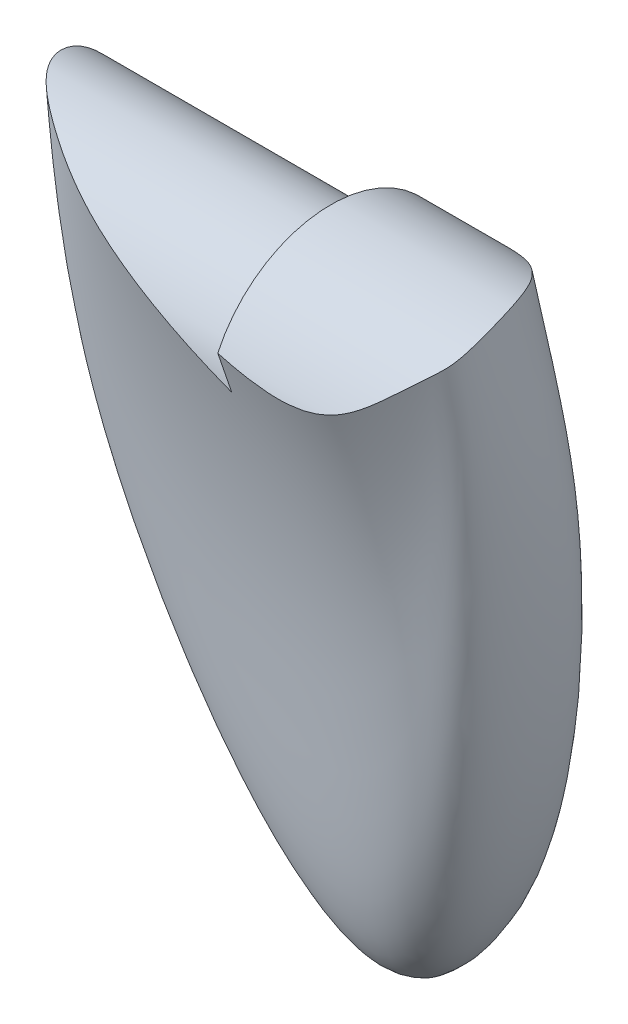
ISO-10303-21;
HEADER;
FILE_DESCRIPTION(('STEP AP214'),'2;1');
FILE_NAME('part.step','',(''),(''),'','','');
FILE_SCHEMA(('AUTOMOTIVE_DESIGN { 1 0 10303 214 1 1 1 1 }'));
ENDSEC;
DATA;
#1=APPLICATION_CONTEXT('core data for automotive mechanical design processes');
#2=APPLICATION_PROTOCOL_DEFINITION('international standard','automotive_design',2000,#1);
#3=PRODUCT_CONTEXT('',#1,'mechanical');
#4=PRODUCT('Part','Part','',(#3));
#5=PRODUCT_RELATED_PRODUCT_CATEGORY('part','',(#4));
#6=PRODUCT_DEFINITION_FORMATION('','',#4);
#7=PRODUCT_DEFINITION_CONTEXT('part definition',#1,'design');
#8=PRODUCT_DEFINITION('design','',#6,#7);
#9=PRODUCT_DEFINITION_SHAPE('','',#8);
#10=(LENGTH_UNIT() NAMED_UNIT(*) SI_UNIT(.MILLI.,.METRE.));
#11=(NAMED_UNIT(*) PLANE_ANGLE_UNIT() SI_UNIT($,.RADIAN.));
#12=(NAMED_UNIT(*) SI_UNIT($,.STERADIAN.) SOLID_ANGLE_UNIT());
#13=UNCERTAINTY_MEASURE_WITH_UNIT(LENGTH_MEASURE(1.E-05),#10,'distance_accuracy_value','');
#14=(GEOMETRIC_REPRESENTATION_CONTEXT(3) GLOBAL_UNCERTAINTY_ASSIGNED_CONTEXT((#13)) GLOBAL_UNIT_ASSIGNED_CONTEXT((#10,
#11,#12)) REPRESENTATION_CONTEXT('',''));
#15=CARTESIAN_POINT('',(0.,0.,0.));
#16=DIRECTION('',(0.,0.,1.));
#17=DIRECTION('',(1.,0.,0.));
#18=AXIS2_PLACEMENT_3D('',#15,#16,#17);
#19=CARTESIAN_POINT('',(-90.2524899999997,-95.0000000000001,-945.847756860003));
#20=DIRECTION('',(1.,0.,0.));
#21=DIRECTION('',(0.,0.,-1.));
#22=AXIS2_PLACEMENT_3D('',#19,#20,#21);
#23=PLANE('',#22);
#24=CARTESIAN_POINT('',(-90.2524899999997,-95.0000000000001,-945.847756860003));
#25=DIRECTION('',(-1.,0.,0.));
#26=DIRECTION('',(0.,0.,1.));
#27=AXIS2_PLACEMENT_3D('',#24,#25,#26);
#28=CIRCLE('',#27,20.);
#29=CARTESIAN_POINT('',(-90.2524899999997,-92.6686733749196,-925.984098683132));
#30=VERTEX_POINT('',#29);
#31=CARTESIAN_POINT('',(-90.25249,-89.625929697021,-965.112215543778));
#32=VERTEX_POINT('',#31);
#33=EDGE_CURVE('E57',#30,#32,#28,.T.);
#34=ORIENTED_EDGE('',*,*,#33,.F.);
#35=CARTESIAN_POINT('',(-90.2524899999997,-95.,-926.723416295062));
#36=CARTESIAN_POINT('',(-90.2524899999997,-94.4090730576183,-926.539240503666));
#37=CARTESIAN_POINT('',(-90.2524899999997,-93.8188409707018,-926.352835742744));
#38=CARTESIAN_POINT('',(-90.2524899999997,-92.6399236996346,-925.975636559248));
#39=CARTESIAN_POINT('',(-90.2524899999997,-92.0512382047961,-925.784843107729));
#40=CARTESIAN_POINT('',(-90.2524899999997,-90.8754079263631,-925.398885467401));
#41=CARTESIAN_POINT('',(-90.2524899999997,-90.2882629076525,-925.203721994847));
#42=CARTESIAN_POINT('',(-90.2524899999997,-89.1155060581281,-924.809046963056));
#43=CARTESIAN_POINT('',(-90.2524899999997,-88.5298940700073,-924.609535871231));
#44=CARTESIAN_POINT('',(-90.2524899999997,-87.3601949122836,-924.206190859622));
#45=CARTESIAN_POINT('',(-90.2524899999997,-86.7761076647844,-924.002357165726));
#46=CARTESIAN_POINT('',(-90.2524899999997,-85.609453047112,-923.590396828681));
#47=CARTESIAN_POINT('',(-90.2524899999997,-85.0268856679167,-923.382270211082));
#48=CARTESIAN_POINT('',(-90.2524899999997,-83.8632550007819,-922.961753539025));
#49=CARTESIAN_POINT('',(-90.2524899999997,-83.2821917986663,-922.749363247095));
#50=CARTESIAN_POINT('',(-90.2524899999997,-82.1215567310893,-922.320353362071));
#51=CARTESIAN_POINT('',(-90.2524899999997,-81.541985035455,-922.103733309556));
#52=CARTESIAN_POINT('',(-90.2524899999997,-80.3843192046325,-921.666300982653));
#53=CARTESIAN_POINT('',(-90.2524899999997,-79.8062253227877,-921.445488037859));
#54=CARTESIAN_POINT('',(-90.2524899999998,-78.6514994079251,-920.99971135939));
#55=CARTESIAN_POINT('',(-90.2524899999998,-78.0748677104334,-920.774746756545));
#56=CARTESIAN_POINT('',(-90.2524899999999,-77.4990347637986,-920.547756860003));
#57=B_SPLINE_CURVE_WITH_KNOTS('',3,(#35,#36,#37,#38,#39,#40,#41,#42,#43,#44,#45,#46,#47,#48,#49,
#50,#51,#52,#53,#54,#55,#56),.UNSPECIFIED.,.F.,.F.,(4,2,2,2,2,2,2,2,2,2,4),(0.,1.85688482362829,
3.71336266646155,5.56953842523674,7.42551560213728,9.28139602830032,11.1372654126576,
12.9932384510714,14.8494142123217,16.7058893007427,18.5627575619083),.UNSPECIFIED.);
#58=CARTESIAN_POINT('',(-90.25249,-84.4609710714284,-923.177757538372));
#59=VERTEX_POINT('',#58);
#60=EDGE_CURVE('E74',#30,#59,#57,.T.);
#61=ORIENTED_EDGE('',*,*,#60,.T.);
#62=CARTESIAN_POINT('',(-90.2524899999997,-95.0000000000001,-945.847756860003));
#63=DIRECTION('',(1.,0.,0.));
#64=DIRECTION('',(0.,0.,-1.));
#65=AXIS2_PLACEMENT_3D('',#62,#63,#64);
#66=CIRCLE('',#65,25.);
#67=CARTESIAN_POINT('',(-90.2524899999998,-78.9803625101528,-965.040755966288));
#68=VERTEX_POINT('',#67);
#69=EDGE_CURVE('E11',#68,#59,#66,.T.);
#70=ORIENTED_EDGE('',*,*,#69,.F.);
#71=CARTESIAN_POINT('',(-90.2524899999999,-69.8499999999999,-964.959969940443));
#72=CARTESIAN_POINT('',(-90.2524899999998,-70.2066298722056,-964.964771969543));
#73=CARTESIAN_POINT('',(-90.2524899999998,-70.5632645084135,-964.969195129858));
#74=CARTESIAN_POINT('',(-90.2524899999997,-71.2765402264112,-964.977455587516));
#75=CARTESIAN_POINT('',(-90.2524899999997,-71.6331813081935,-964.981292885494));
#76=CARTESIAN_POINT('',(-90.2524899999998,-72.7031089951852,-964.992183793422));
#77=CARTESIAN_POINT('',(-90.2524899999997,-73.4164018040489,-964.998616439395));
#78=CARTESIAN_POINT('',(-90.2524899999997,-74.8429940811658,-965.010594563323));
#79=CARTESIAN_POINT('',(-90.2524899999997,-75.5562935494145,-965.016140041833));
#80=CARTESIAN_POINT('',(-90.2524899999997,-76.982896510297,-965.026762155813));
#81=CARTESIAN_POINT('',(-90.2524899999998,-77.6962000029335,-965.03183879091));
#82=CARTESIAN_POINT('',(-90.2524899999998,-79.3311964211859,-965.043221944188));
#83=CARTESIAN_POINT('',(-90.2524899999997,-80.2528898529654,-965.0494544832));
#84=CARTESIAN_POINT('',(-90.2524899999997,-82.0962770190019,-965.061826600559));
#85=CARTESIAN_POINT('',(-90.2524899999997,-83.0179707532588,-965.067966178937));
#86=CARTESIAN_POINT('',(-90.2524899999997,-84.8613579595951,-965.080261315284));
#87=CARTESIAN_POINT('',(-90.2524899999997,-85.7830514316747,-965.086416873252));
#88=CARTESIAN_POINT('',(-90.2524899999997,-87.626439662135,-965.098767369478));
#89=CARTESIAN_POINT('',(-90.2524899999997,-88.5481344205153,-965.104962307804));
#90=CARTESIAN_POINT('',(-90.2524899999997,-90.3915239887196,-965.117367683752));
#91=CARTESIAN_POINT('',(-90.2524899999997,-91.3132187985435,-965.123578121377));
#92=CARTESIAN_POINT('',(-90.2524899999998,-93.1566089734964,-965.135962610086));
#93=CARTESIAN_POINT('',(-90.2524899999998,-94.0783043386255,-965.142136661159));
#94=CARTESIAN_POINT('',(-90.25249,-94.9999999999996,-965.148266574435));
#95=B_SPLINE_CURVE_WITH_KNOTS('',3,(#71,#72,#73,#74,#75,#76,#77,#78,#79,#80,#81,#82,#83,#84,#85,
#86,#87,#88,#89,#90,#91,#92,#93,#94),.UNSPECIFIED.,.F.,.F.,(4,2,2,2,2,2,2,2,2,2,2,4),(0.,
1.06998591410251,2.13997066916165,4.27993489285478,6.41989777801416,8.55986236437721,
11.3250058594289,14.0901484084937,16.8552904881428,19.6204372188394,22.3855844165713,
25.1507325478523),.UNSPECIFIED.);
#96=EDGE_CURVE('E76',#68,#32,#95,.T.);
#97=ORIENTED_EDGE('',*,*,#96,.T.);
#98=EDGE_LOOP('',(#34,#61,#70,#97));
#99=FACE_BOUND('',#98,.T.);
#100=ADVANCED_FACE('F40',(#99),#23,.F.);
#101=CARTESIAN_POINT('',(-90.2524899999997,-95.0000000000001,-945.847756860003));
#102=DIRECTION('',(-1.,0.,0.));
#103=DIRECTION('',(0.,0.,1.));
#104=AXIS2_PLACEMENT_3D('',#101,#102,#103);
#105=CYLINDRICAL_SURFACE('',#104,20.);
#106=CARTESIAN_POINT('',(-90.2524899999998,-92.6686733749417,-925.984098683139));
#107=CARTESIAN_POINT('',(-90.6635311227346,-92.5355579964912,-925.999718818907));
#108=CARTESIAN_POINT('',(-91.0743375881089,-92.4018872980755,-926.016766769771));
#109=CARTESIAN_POINT('',(-91.8955439579553,-92.1336997436798,-926.053752425884));
#110=CARTESIAN_POINT('',(-92.3059438625493,-91.9991828879537,-926.073690130267));
#111=CARTESIAN_POINT('',(-93.1265349789843,-91.7295231013382,-926.116496462355));
#112=CARTESIAN_POINT('',(-93.5367260778569,-91.5943799791581,-926.139366051483));
#113=CARTESIAN_POINT('',(-94.356792006551,-91.3236703575145,-926.188064289084));
#114=CARTESIAN_POINT('',(-94.7666668363238,-91.1881038579857,-926.213892938013));
#115=CARTESIAN_POINT('',(-95.9959993039705,-90.7808962384889,-926.295880716376));
#116=CARTESIAN_POINT('',(-96.8150109238682,-90.5087977050869,-926.356533669639));
#117=CARTESIAN_POINT('',(-98.4518345532382,-89.9638368124539,-926.490179464408));
#118=CARTESIAN_POINT('',(-99.2696464753108,-89.6909744014122,-926.563173163907));
#119=CARTESIAN_POINT('',(-100.904865455493,-89.1442769339149,-926.722076466845));
#120=CARTESIAN_POINT('',(-101.722270658625,-88.8704410798773,-926.808002466979));
#121=CARTESIAN_POINT('',(-103.355280202844,-88.3221442518087,-926.993314738085));
#122=CARTESIAN_POINT('',(-104.170884671523,-88.0476833250633,-927.092700022095));
#123=CARTESIAN_POINT('',(-105.799919498908,-87.4980674621428,-927.305700140772));
#124=CARTESIAN_POINT('',(-106.613350050536,-87.2229125920687,-927.419313666833));
#125=CARTESIAN_POINT('',(-108.237641258128,-86.6718365907113,-927.661709805271));
#126=CARTESIAN_POINT('',(-109.048502060556,-86.3959155048439,-927.790491536564));
#127=CARTESIAN_POINT('',(-110.636748875987,-85.8536794547072,-928.059195988459));
#128=CARTESIAN_POINT('',(-111.414246390517,-85.5873937056906,-928.198517145112));
#129=CARTESIAN_POINT('',(-112.965944436853,-85.0541487834496,-928.493423574406));
#130=CARTESIAN_POINT('',(-113.740144909998,-84.787189598377,-928.649009135175));
#131=CARTESIAN_POINT('',(-115.284708342912,-84.2527327717985,-928.977821813774));
#132=CARTESIAN_POINT('',(-116.055070906235,-83.9852350785153,-929.151050716052));
#133=CARTESIAN_POINT('',(-117.59237539412,-83.4495725048144,-929.517018484473));
#134=CARTESIAN_POINT('',(-118.359309891867,-83.1814072411056,-929.709788064021));
#135=CARTESIAN_POINT('',(-119.887604393567,-82.6452421065619,-930.116475300277));
#136=CARTESIAN_POINT('',(-120.648964660649,-82.377242228474,-930.330391951749));
#137=CARTESIAN_POINT('',(-121.785910698114,-81.9757980723616,-930.668799622657));
#138=CARTESIAN_POINT('',(-122.164025010344,-81.8420825864512,-930.784518117044));
#139=CARTESIAN_POINT('',(-122.918402118602,-81.574908917752,-931.022140500779));
#140=CARTESIAN_POINT('',(-123.294664909727,-81.4414507356448,-931.144044406495));
#141=CARTESIAN_POINT('',(-124.07701410087,-81.1635717412408,-931.40502098827));
#142=CARTESIAN_POINT('',(-124.482919056129,-81.0191826376936,-931.544672466949));
#143=CARTESIAN_POINT('',(-125.291974626453,-80.730914213843,-931.832243615197));
#144=CARTESIAN_POINT('',(-125.695125244297,-80.5870348930256,-931.980163276425));
#145=CARTESIAN_POINT('',(-126.498644858149,-80.3002533859251,-932.284528067146));
#146=CARTESIAN_POINT('',(-126.899013308511,-80.1573513914006,-932.440974818597));
#147=CARTESIAN_POINT('',(-127.696875949448,-79.8731779570622,-932.762448971128));
#148=CARTESIAN_POINT('',(-128.094370131324,-79.7319065221833,-932.927476398171));
#149=CARTESIAN_POINT('',(-128.886633241617,-79.451563875217,-933.266243203488));
#150=CARTESIAN_POINT('',(-129.28140095601,-79.3124936116128,-933.439986209709));
#151=CARTESIAN_POINT('',(-130.068035260978,-79.0372723816105,-933.796118537112));
#152=CARTESIAN_POINT('',(-130.459901854264,-78.9011214124849,-933.978507850214));
#153=CARTESIAN_POINT('',(-131.631840309202,-78.4978119999623,-934.538924883781));
#154=CARTESIAN_POINT('',(-132.407610137025,-78.2360259218744,-934.929927672405));
#155=CARTESIAN_POINT('',(-133.946023655253,-77.7327002518935,-935.744824816601));
#156=CARTESIAN_POINT('',(-134.708692642835,-77.4911170415075,-936.168644295765));
#157=CARTESIAN_POINT('',(-135.843986526498,-77.1472357691205,-936.828864300274));
#158=CARTESIAN_POINT('',(-136.220975836605,-77.0356882958572,-937.05302553283));
#159=CARTESIAN_POINT('',(-136.971960416416,-76.819335105869,-937.509459654164));
#160=CARTESIAN_POINT('',(-137.345955791474,-76.7145291509945,-937.741732255954));
#161=CARTESIAN_POINT('',(-138.090426873609,-76.5123048667037,-938.214205114278));
#162=CARTESIAN_POINT('',(-138.460905458456,-76.4148799404074,-938.454398009623));
#163=CARTESIAN_POINT('',(-139.198316444382,-76.2278376509999,-938.943093082853));
#164=CARTESIAN_POINT('',(-139.565249025899,-76.1382198887404,-939.19159483504));
#165=CARTESIAN_POINT('',(-140.294619441816,-75.9673727478206,-939.697128084375));
#166=CARTESIAN_POINT('',(-140.657061385291,-75.8861351112779,-939.954150848223));
#167=CARTESIAN_POINT('',(-141.376799616757,-75.7324585746514,-940.477808840567));
#168=CARTESIAN_POINT('',(-141.734096421666,-75.6600187851555,-940.744443093858));
#169=CARTESIAN_POINT('',(-142.379854787743,-75.5363927571752,-941.241078560732));
#170=CARTESIAN_POINT('',(-142.669395775192,-75.4837074134828,-941.469300168079));
#171=CARTESIAN_POINT('',(-143.242410492633,-75.3851223784802,-941.934560028501));
#172=CARTESIAN_POINT('',(-143.52588554564,-75.3392211943344,-942.171596327515));
#173=CARTESIAN_POINT('',(-144.085295039925,-75.2548228155511,-942.655829411731));
#174=CARTESIAN_POINT('',(-144.361227935303,-75.2163271291831,-942.90302825431));
#175=CARTESIAN_POINT('',(-144.902341141262,-75.1477805566828,-943.40768818167));
#176=CARTESIAN_POINT('',(-145.167564319596,-75.1176923811277,-943.6650979767));
#177=CARTESIAN_POINT('',(-145.686291507559,-75.066866031112,-944.192367909801));
#178=CARTESIAN_POINT('',(-145.939796412981,-75.0461271408895,-944.462227093027));
#179=CARTESIAN_POINT('',(-146.43251304585,-75.0154198362554,-945.015186048762));
#180=CARTESIAN_POINT('',(-146.671730355832,-75.0054471888401,-945.298280571774));
#181=CARTESIAN_POINT('',(-147.069306377844,-74.9989667588478,-945.797580491359));
#182=CARTESIAN_POINT('',(-147.231685121428,-74.9994908907217,-946.010552785719));
#183=CARTESIAN_POINT('',(-147.546755232767,-75.0077004815069,-946.443418621402));
#184=CARTESIAN_POINT('',(-147.699447198496,-75.0153854979104,-946.663311734241));
#185=CARTESIAN_POINT('',(-147.994322205278,-75.0385969709975,-947.109624284485));
#186=CARTESIAN_POINT('',(-148.136505956601,-75.0541228971423,-947.336043279353));
#187=CARTESIAN_POINT('',(-148.409766337001,-75.0936753517908,-947.794876616813));
#188=CARTESIAN_POINT('',(-148.540839276792,-75.1177046902079,-948.027292917623));
#189=CARTESIAN_POINT('',(-148.791376386913,-75.1748590513024,-948.4972482174));
#190=CARTESIAN_POINT('',(-148.910839453176,-75.207984937892,-948.734787700948));
#191=CARTESIAN_POINT('',(-149.137876410878,-75.2838240968829,-949.213952918215));
#192=CARTESIAN_POINT('',(-149.245450857479,-75.3265369213197,-949.45557846052));
#193=CARTESIAN_POINT('',(-149.4996750274,-75.4459101592732,-950.063900144918));
#194=CARTESIAN_POINT('',(-149.638853024582,-75.528851267123,-950.432528075368));
#195=CARTESIAN_POINT('',(-149.891461669619,-75.7180810774555,-951.172564208351));
#196=CARTESIAN_POINT('',(-150.004890234315,-75.8243716675695,-951.543972633319));
#197=CARTESIAN_POINT('',(-150.207232354833,-76.0606608677692,-952.286171497454));
#198=CARTESIAN_POINT('',(-150.296131590564,-76.1906732532533,-952.656961450555));
#199=CARTESIAN_POINT('',(-150.450324231503,-76.4742260911626,-953.394396342027));
#200=CARTESIAN_POINT('',(-150.515618572117,-76.6277656109212,-953.761041444091));
#201=CARTESIAN_POINT('',(-150.622879478274,-76.9562982193081,-954.48378063159));
#202=CARTESIAN_POINT('',(-150.665062217891,-77.1310731421325,-954.839941935339));
#203=CARTESIAN_POINT('',(-150.727585423323,-77.5024046550793,-955.542709266896));
#204=CARTESIAN_POINT('',(-150.747925223366,-77.6989619089252,-955.889315003135));
#205=CARTESIAN_POINT('',(-150.767099139817,-78.1129124831366,-956.570881897229));
#206=CARTESIAN_POINT('',(-150.765913961641,-78.3303243235305,-956.905832338064));
#207=CARTESIAN_POINT('',(-150.74212726625,-78.7844228340691,-957.561597100688));
#208=CARTESIAN_POINT('',(-150.719527764473,-79.0211076883912,-957.88241274982));
#209=CARTESIAN_POINT('',(-150.662980919674,-79.4375848237046,-958.413108652963));
#210=CARTESIAN_POINT('',(-150.634548628781,-79.6128794695705,-958.627142504431));
#211=CARTESIAN_POINT('',(-150.567188643869,-79.9713576718115,-959.046850188068));
#212=CARTESIAN_POINT('',(-150.528259566516,-80.1545422652986,-959.252522914242));
#213=CARTESIAN_POINT('',(-150.439767996976,-80.5281226647389,-959.655007717419));
#214=CARTESIAN_POINT('',(-150.390201327801,-80.7185212791181,-959.85181627696));
#215=CARTESIAN_POINT('',(-150.307795007486,-81.0087114933831,-960.139796706826));
#216=CARTESIAN_POINT('',(-150.279002530876,-81.1061491479019,-960.234531967728));
#217=CARTESIAN_POINT('',(-150.218687189713,-81.3024910194072,-960.421590561195));
#218=CARTESIAN_POINT('',(-150.187164303177,-81.4013952481967,-960.513913874332));
#219=CARTESIAN_POINT('',(-150.121389186912,-81.6005320185707,-960.696072036309));
#220=CARTESIAN_POINT('',(-150.087137596469,-81.700764244469,-960.785907461408));
#221=CARTESIAN_POINT('',(-150.015740185984,-81.9024365893155,-960.963041898804));
#222=CARTESIAN_POINT('',(-149.978594344541,-82.0038767171901,-961.05034089234));
#223=CARTESIAN_POINT('',(-149.901007116358,-82.2077015118126,-961.222244344811));
#224=CARTESIAN_POINT('',(-149.860567115787,-82.3100857653563,-961.306849916496));
#225=CARTESIAN_POINT('',(-149.77603768834,-82.5155931063949,-961.473283082694));
#226=CARTESIAN_POINT('',(-149.731948457899,-82.6187161538483,-961.555110826402));
#227=CARTESIAN_POINT('',(-149.622323656609,-82.8646231270179,-961.746348553056));
#228=CARTESIAN_POINT('',(-149.554992776226,-83.0076263671654,-961.854458868069));
#229=CARTESIAN_POINT('',(-149.412070920839,-83.2937329095017,-962.064872562844));
#230=CARTESIAN_POINT('',(-149.336481685193,-83.4368361843369,-962.167177158524));
#231=CARTESIAN_POINT('',(-149.176531944157,-83.7223103016649,-962.365745270954));
#232=CARTESIAN_POINT('',(-149.092172620835,-83.8646812401572,-962.462009599038));
#233=CARTESIAN_POINT('',(-148.914683659327,-84.1473739384419,-962.648026155623));
#234=CARTESIAN_POINT('',(-148.821583199199,-84.2877008280796,-962.737798394808));
#235=CARTESIAN_POINT('',(-148.626321770468,-84.5659490632599,-962.911093317433));
#236=CARTESIAN_POINT('',(-148.524158996091,-84.7038699227903,-962.994614749182));
#237=CARTESIAN_POINT('',(-148.310991299677,-84.9764723358256,-963.155383574027));
#238=CARTESIAN_POINT('',(-148.199986645737,-85.1111539873862,-963.232631157211));
#239=CARTESIAN_POINT('',(-147.911979060291,-85.4428173820273,-963.417963889118));
#240=CARTESIAN_POINT('',(-147.729671365305,-85.6373701578764,-963.522214543713));
#241=CARTESIAN_POINT('',(-147.347858764864,-86.0158130135087,-963.71755767547));
#242=CARTESIAN_POINT('',(-147.14835401575,-86.1997031902022,-963.808650272236));
#243=CARTESIAN_POINT('',(-146.733705922363,-86.556285246623,-963.979024170425));
#244=CARTESIAN_POINT('',(-146.518516553657,-86.7289411048481,-964.058268443371));
#245=CARTESIAN_POINT('',(-146.075213176168,-87.0619623971097,-964.205881985462));
#246=CARTESIAN_POINT('',(-145.847095002474,-87.2223238310038,-964.274247722856));
#247=CARTESIAN_POINT('',(-145.435115946054,-87.4942716734948,-964.386372490707));
#248=CARTESIAN_POINT('',(-145.253491446325,-87.6084477454338,-964.432133919771));
#249=CARTESIAN_POINT('',(-144.884796180694,-87.8295858392085,-964.518569158611));
#250=CARTESIAN_POINT('',(-144.697726576615,-87.9365493840607,-964.559244044034));
#251=CARTESIAN_POINT('',(-144.129186165042,-88.2469632832698,-964.674477526292));
#252=CARTESIAN_POINT('',(-143.740511587929,-88.439853386433,-964.742211195647));
#253=CARTESIAN_POINT('',(-142.948644329121,-88.7989069912318,-964.863073866429));
#254=CARTESIAN_POINT('',(-142.545440645982,-88.9650496962099,-964.916191526144));
#255=CARTESIAN_POINT('',(-141.728267305681,-89.2720258022009,-965.010639293532));
#256=CARTESIAN_POINT('',(-141.314298482625,-89.4128611574367,-965.051970311511));
#257=CARTESIAN_POINT('',(-140.427484276306,-89.6863956798758,-965.129567758495));
#258=CARTESIAN_POINT('',(-139.953592173193,-89.8160316521175,-965.164610270044));
#259=CARTESIAN_POINT('',(-138.998261459276,-90.0475292095418,-965.225251894502));
#260=CARTESIAN_POINT('',(-138.516818610963,-90.1493745623189,-965.250845491401));
#261=CARTESIAN_POINT('',(-137.548852882948,-90.3274122619265,-965.294486900054));
#262=CARTESIAN_POINT('',(-137.062329249849,-90.4036007469369,-965.312533575961));
#263=CARTESIAN_POINT('',(-136.085025927576,-90.5329194978041,-965.342617394099));
#264=CARTESIAN_POINT('',(-135.594239325837,-90.5859997172922,-965.354641501434));
#265=CARTESIAN_POINT('',(-134.610957283808,-90.6716716128595,-965.373828671271));
#266=CARTESIAN_POINT('',(-134.118462307055,-90.7042684669099,-965.380992962318));
#267=CARTESIAN_POINT('',(-133.132647605948,-90.7520674202709,-965.391442380675));
#268=CARTESIAN_POINT('',(-132.639327913254,-90.7672701726391,-965.394727653622));
#269=CARTESIAN_POINT('',(-131.563082499905,-90.7849343410501,-965.398544998937));
#270=CARTESIAN_POINT('',(-130.980113924572,-90.7845886103424,-965.398470484896));
#271=CARTESIAN_POINT('',(-129.814400505147,-90.7692009727837,-965.395144590425));
#272=CARTESIAN_POINT('',(-129.231655673765,-90.7541583277494,-965.391893050423));
#273=CARTESIAN_POINT('',(-128.066492173782,-90.7140865927251,-965.383144147499));
#274=CARTESIAN_POINT('',(-127.484073543907,-90.689056497922,-965.377646558606));
#275=CARTESIAN_POINT('',(-126.320274300529,-90.6331496582562,-965.365221668736));
#276=CARTESIAN_POINT('',(-125.738893298596,-90.6022802475069,-965.358296160238));
#277=CARTESIAN_POINT('',(-124.57635292089,-90.5380269136874,-965.343702184782));
#278=CARTESIAN_POINT('',(-123.995193527028,-90.5046432887167,-965.336033805874));
#279=CARTESIAN_POINT('',(-122.832893873305,-90.4378579346278,-965.32050808217));
#280=CARTESIAN_POINT('',(-122.251753613348,-90.4044562060182,-965.312650742441));
#281=CARTESIAN_POINT('',(-121.235187663889,-90.3473891660932,-965.299076857095));
#282=CARTESIAN_POINT('',(-120.799781834126,-90.3233834800056,-965.293317767616));
#283=CARTESIAN_POINT('',(-119.928902861578,-90.27657732907,-965.282001291624));
#284=CARTESIAN_POINT('',(-119.493429718818,-90.2537768637948,-965.276443905039));
#285=CARTESIAN_POINT('',(-118.186877326053,-90.1874242143439,-965.26015489853));
#286=CARTESIAN_POINT('',(-117.315688282141,-90.1459220991137,-965.249806748029));
#287=CARTESIAN_POINT('',(-115.572915516758,-90.0678157962584,-965.230099116542));
#288=CARTESIAN_POINT('',(-114.701331751665,-90.0312125473013,-965.220739825104));
#289=CARTESIAN_POINT('',(-112.958029416636,-89.961343335671,-965.202684531092));
#290=CARTESIAN_POINT('',(-112.086310847398,-89.9280773562658,-965.193988525193));
#291=CARTESIAN_POINT('',(-110.341852582347,-89.8645241827804,-965.177215449295));
#292=CARTESIAN_POINT('',(-109.46911276615,-89.8342401177544,-965.169139031378));
#293=CARTESIAN_POINT('',(-107.723520295486,-89.7768470794479,-965.153702978012));
#294=CARTESIAN_POINT('',(-106.850667640802,-89.7497381123155,-965.14634334395));
#295=CARTESIAN_POINT('',(-105.104897923506,-89.6990868266137,-965.132491964934));
#296=CARTESIAN_POINT('',(-104.231980866783,-89.6755443185281,-965.126000173866));
#297=CARTESIAN_POINT('',(-102.486034498289,-89.6327687759911,-965.114134845554));
#298=CARTESIAN_POINT('',(-101.613005187025,-89.6135357226839,-965.108761303418));
#299=CARTESIAN_POINT('',(-100.303104280058,-89.5889140783404,-965.101853108376));
#300=CARTESIAN_POINT('',(-99.8662753777302,-89.5814098455775,-965.099741919653));
#301=CARTESIAN_POINT('',(-98.9925888315149,-89.5680720613664,-965.095982931103));
#302=CARTESIAN_POINT('',(-98.5557311875809,-89.5622385126718,-965.09433513204));
#303=CARTESIAN_POINT('',(-97.6820045076329,-89.552565511149,-965.091599585406));
#304=CARTESIAN_POINT('',(-97.2451354723335,-89.5487259995892,-965.090511821338));
#305=CARTESIAN_POINT('',(-96.3713815851254,-89.5434686988313,-965.08902174461));
#306=CARTESIAN_POINT('',(-95.9344967332748,-89.5420509015038,-965.088619429647));
#307=CARTESIAN_POINT('',(-95.2790406247445,-89.542165636796,-965.088651945095));
#308=CARTESIAN_POINT('',(-95.0604689700535,-89.5425779086136,-965.088768910612));
#309=CARTESIAN_POINT('',(-94.6233290011027,-89.5442376918665,-965.089239612405));
#310=CARTESIAN_POINT('',(-94.4047606868416,-89.5454852029729,-965.089593348587));
#311=CARTESIAN_POINT('',(-93.9676310428159,-89.5489137184001,-965.09056490809));
#312=CARTESIAN_POINT('',(-93.7490697130765,-89.5510947257885,-965.09118273228));
#313=CARTESIAN_POINT('',(-93.3119610826098,-89.5564910873563,-965.092709924661));
#314=CARTESIAN_POINT('',(-93.093413781872,-89.5597064407609,-965.093619292634));
#315=CARTESIAN_POINT('',(-92.4377415956131,-89.5707672050059,-965.096743580155));
#316=CARTESIAN_POINT('',(-92.0006422412286,-89.5800268598501,-965.099354552195));
#317=CARTESIAN_POINT('',(-91.3450487858757,-89.5959656087334,-965.103832327028));
#318=CARTESIAN_POINT('',(-91.1265261887377,-89.6016200911085,-965.105418477484));
#319=CARTESIAN_POINT('',(-90.6894973254501,-89.6134373521116,-965.108727280158));
#320=CARTESIAN_POINT('',(-90.4709910591912,-89.6196001269594,-965.11044993136));
#321=CARTESIAN_POINT('',(-90.25249,-89.625929697044,-965.112215543779));
#322=B_SPLINE_CURVE_WITH_KNOTS('',3,(#106,#107,#108,#109,#110,#111,#112,#113,#114,#115,#116,
#117,#118,#119,#120,#121,#122,#123,#124,#125,#126,#127,#128,#129,#130,#131,#132,#133,#134,#135,
#136,#137,#138,#139,#140,#141,#142,#143,#144,#145,#146,#147,#148,#149,#150,#151,#152,#153,#154,
#155,#156,#157,#158,#159,#160,#161,#162,#163,#164,#165,#166,#167,#168,#169,#170,#171,#172,#173,
#174,#175,#176,#177,#178,#179,#180,#181,#182,#183,#184,#185,#186,#187,#188,#189,#190,#191,#192,
#193,#194,#195,#196,#197,#198,#199,#200,#201,#202,#203,#204,#205,#206,#207,#208,#209,#210,#211,
#212,#213,#214,#215,#216,#217,#218,#219,#220,#221,#222,#223,#224,#225,#226,#227,#228,#229,#230,
#231,#232,#233,#234,#235,#236,#237,#238,#239,#240,#241,#242,#243,#244,#245,#246,#247,#248,#249,
#250,#251,#252,#253,#254,#255,#256,#257,#258,#259,#260,#261,#262,#263,#264,#265,#266,#267,#268,
#269,#270,#271,#272,#273,#274,#275,#276,#277,#278,#279,#280,#281,#282,#283,#284,#285,#286,#287,
#288,#289,#290,#291,#292,#293,#294,#295,#296,#297,#298,#299,#300,#301,#302,#303,#304,#305,#306,
#307,#308,#309,#310,#311,#312,#313,#314,#315,#316,#317,#318,#319,#320,#321),.UNSPECIFIED.,.F.,
.F.,(4,2,2,2,2,2,2,2,2,2,2,2,2,2,2,2,2,2,2,2,2,2,2,2,2,2,2,2,2,2,2,2,2,2,2,2,2,2,2,2,2,2,2,2,2,
2,2,2,2,2,2,2,2,2,2,2,2,2,2,2,2,2,2,2,2,2,2,2,2,2,2,2,2,2,2,2,2,2,2,2,2,2,2,2,2,2,2,2,2,2,2,2,2,
2,2,2,2,2,2,2,2,2,2,2,2,2,2,4),(0.,1.29701857076181,2.59403675208993,3.89148134419777,
5.18892613645497,7.78430266133772,10.379859704806,12.9787357850444,15.5774213943924,
18.1758681715153,20.7741640853894,23.2746896892544,25.7752595979959,28.2760826658376,
30.780899257433,33.2855968385665,34.5378213374255,35.7900491500441,37.1486411914933,
38.507231862471,39.8660818622384,41.224935973579,42.5843604926781,43.9437837415196,
46.6648288228504,49.3798386761598,50.7374136643239,52.0949406686766,53.451239692407,
54.8074693333516,56.1623494986231,57.5170925790323,58.634166211159,59.750993667173,
60.8680483459559,61.9800669870222,63.0920004797852,64.203496630119,65.0066168254866,
65.8096873952115,66.6127036341153,67.4159854742036,68.2193436295098,69.0226642544692,
70.2289990941546,71.4354314929126,72.6425667174052,73.8496541008028,75.0452493943154,
76.2408811285042,77.4375846572451,78.6341755677598,79.4681125444735,80.3021594764632,
81.13653450898,81.5532392904007,81.9699474272764,82.3865582225413,82.80317209849,
83.2196115615808,83.6360286225302,84.2102619180152,84.7843745019104,85.3584098047312,
85.9305928329416,86.5028901327501,87.07517008637,87.9328656636498,88.7905534442699,
89.6508680349232,90.5114613619727,91.1692830715088,91.8269654358087,93.1427975625544,
94.4596478859025,95.7763964788853,97.2529932465693,98.7304506521032,100.208130342255,
101.688994563893,103.169484288477,104.649918426601,106.398547036392,108.147263479231,
109.896155900556,111.64286614522,113.389369615087,115.135826326117,116.444140200265,
117.752453610547,120.369150061178,122.986347179278,125.603531174799,128.223432865827,
130.843339629788,133.463107126999,136.082863161243,137.393555886669,138.704250772346,
140.014907051175,141.325558930254,141.981273750749,142.63698831301,143.292705030103,
143.948421256107,145.260021153089,145.915825352012,146.571624674097),.UNSPECIFIED.);
#323=EDGE_CURVE('E81',#30,#32,#322,.T.);
#324=ORIENTED_EDGE('',*,*,#323,.F.);
#325=ORIENTED_EDGE('',*,*,#33,.T.);
#326=EDGE_LOOP('',(#324,#325));
#327=FACE_BOUND('',#326,.T.);
#328=ADVANCED_FACE('F85',(#327),#105,.T.);
#329=CARTESIAN_POINT('',(-90.2524899999997,-95.0000000000001,-945.847756860003));
#330=DIRECTION('',(1.,0.,0.));
#331=DIRECTION('',(0.,0.,-1.));
#332=AXIS2_PLACEMENT_3D('',#329,#330,#331);
#333=CYLINDRICAL_SURFACE('',#332,25.);
#334=ORIENTED_EDGE('',*,*,#69,.T.);
#335=CARTESIAN_POINT('',(-90.25249,-84.4609710714284,-923.177757538372));
#336=CARTESIAN_POINT('',(-89.7128827588308,-84.5551261003449,-923.133982125621));
#337=CARTESIAN_POINT('',(-89.1725739627747,-84.6463180792081,-923.092305398491));
#338=CARTESIAN_POINT('',(-88.0888589561048,-84.8220652604741,-923.013157683814));
#339=CARTESIAN_POINT('',(-87.5454483298647,-84.9065991935947,-922.975700022324));
#340=CARTESIAN_POINT('',(-86.4561634200325,-85.0678750009712,-922.905205587749));
#341=CARTESIAN_POINT('',(-85.9102864529173,-85.1446024193348,-922.872176981568));
#342=CARTESIAN_POINT('',(-84.8166506484704,-85.2887580119133,-922.81087520912));
#343=CARTESIAN_POINT('',(-84.2688907811959,-85.3561798049832,-922.782605303148));
#344=CARTESIAN_POINT('',(-83.1524840201803,-85.4820291456069,-922.730381751496));
#345=CARTESIAN_POINT('',(-82.5837824199577,-85.5400551459706,-922.706615713494));
#346=CARTESIAN_POINT('',(-81.4452154688332,-85.6412542444701,-922.665503444784));
#347=CARTESIAN_POINT('',(-80.8753512723463,-85.6844381677479,-922.648152534468));
#348=CARTESIAN_POINT('',(-79.7348186160805,-85.7525632326834,-922.620913087829));
#349=CARTESIAN_POINT('',(-79.164151298673,-85.7775203272887,-922.611018025568));
#350=CARTESIAN_POINT('',(-78.0222964701329,-85.8052922517042,-922.600012181545));
#351=CARTESIAN_POINT('',(-77.4511091883488,-85.8081142753311,-922.598898545851));
#352=CARTESIAN_POINT('',(-76.4688551484549,-85.7900827776332,-922.606038864234));
#353=CARTESIAN_POINT('',(-76.0576545705892,-85.7756259158642,-922.611761652852));
#354=CARTESIAN_POINT('',(-75.2361737176074,-85.7311101500391,-922.629482198099));
#355=CARTESIAN_POINT('',(-74.8258935062257,-85.7010501970602,-922.641480376594));
#356=CARTESIAN_POINT('',(-74.0071923079341,-85.6235310013556,-922.672692994227));
#357=CARTESIAN_POINT('',(-73.5987714655728,-85.5760704285132,-922.691907985026));
#358=CARTESIAN_POINT('',(-72.7888104045504,-85.4625870914611,-922.738419131023));
#359=CARTESIAN_POINT('',(-72.3872414867741,-85.3967401213168,-922.765638877068));
#360=CARTESIAN_POINT('',(-71.5886348798088,-85.2449180433007,-922.82939109944));
#361=CARTESIAN_POINT('',(-71.1915972177493,-85.1589428149838,-922.865923631492));
#362=CARTESIAN_POINT('',(-70.4038092202922,-84.965919224418,-922.949541145127));
#363=CARTESIAN_POINT('',(-70.0130583569938,-84.8588726416202,-922.99662523569));
#364=CARTESIAN_POINT('',(-69.2334551867822,-84.6214726062289,-923.103452605972));
#365=CARTESIAN_POINT('',(-68.8447341898695,-84.4907724065899,-923.163387075414));
#366=CARTESIAN_POINT('',(-68.0775545027504,-84.2077000496451,-923.296687835001));
#367=CARTESIAN_POINT('',(-67.6990970939807,-84.0553252008977,-923.37005579357));
#368=CARTESIAN_POINT('',(-66.9542540706917,-83.7302676392546,-923.531260595215));
#369=CARTESIAN_POINT('',(-66.5878665120798,-83.557588217496,-923.619095094354));
#370=CARTESIAN_POINT('',(-65.8679303372355,-83.1938116898147,-923.810149371154));
#371=CARTESIAN_POINT('',(-65.5143976251244,-83.0026927709758,-923.913387451251));
#372=CARTESIAN_POINT('',(-64.8212681559155,-82.6049369054593,-924.135680021824));
#373=CARTESIAN_POINT('',(-64.4816734520153,-82.3982976850952,-924.254736831677));
#374=CARTESIAN_POINT('',(-63.8165502501912,-81.9726650418338,-924.508825518104));
#375=CARTESIAN_POINT('',(-63.4910217027661,-81.753671662419,-924.643857338451));
#376=CARTESIAN_POINT('',(-62.7599946832013,-81.2409791489126,-924.971767022208));
#377=CARTESIAN_POINT('',(-62.3590475142423,-80.9442091149323,-925.169994469543));
#378=CARTESIAN_POINT('',(-61.5775558089357,-80.3421652520293,-925.592308979928));
#379=CARTESIAN_POINT('',(-61.1970190306476,-80.0368882556441,-925.816405775403));
#380=CARTESIAN_POINT('',(-60.4533448488955,-79.4239519474855,-926.289213793026));
#381=CARTESIAN_POINT('',(-60.09021419638,-79.116291764282,-926.537934452688));
#382=CARTESIAN_POINT('',(-59.3754156342969,-78.5017654031992,-927.060206826561));
#383=CARTESIAN_POINT('',(-59.0238541664567,-78.1949225006587,-927.333930839362));
#384=CARTESIAN_POINT('',(-58.3316294230701,-77.5890565023955,-927.902511211994));
#385=CARTESIAN_POINT('',(-57.9909617549391,-77.290030263957,-928.197358894915));
#386=CARTESIAN_POINT('',(-57.3193735910122,-76.7023641786268,-928.807344194623));
#387=CARTESIAN_POINT('',(-56.9884481448994,-76.4137190396604,-929.122471238133));
#388=CARTESIAN_POINT('',(-56.5385021280695,-76.0250822357589,-929.569586564389));
#389=CARTESIAN_POINT('',(-56.4159384539983,-75.9196181974917,-929.693327035972));
#390=CARTESIAN_POINT('',(-56.1718404951841,-75.7106325603801,-929.943453972102));
#391=CARTESIAN_POINT('',(-56.0503062497784,-75.6071110355825,-930.069840537129));
#392=CARTESIAN_POINT('',(-55.8082296396307,-75.4020501899375,-930.325281944257));
#393=CARTESIAN_POINT('',(-55.6876877141647,-75.3005117222362,-930.45433788766));
#394=CARTESIAN_POINT('',(-55.4483462078032,-75.0991050511832,-930.715618534803));
#395=CARTESIAN_POINT('',(-55.3295482395685,-74.9992383830978,-930.847845906098));
#396=CARTESIAN_POINT('',(-55.0962017990908,-74.8020199970913,-931.114501563026));
#397=CARTESIAN_POINT('',(-54.9816210559737,-74.7046527181065,-931.248889946578));
#398=CARTESIAN_POINT('',(-54.756951673301,-74.5109501478326,-931.522015730924));
#399=CARTESIAN_POINT('',(-54.6468614351784,-74.4146144984628,-931.660751552427));
#400=CARTESIAN_POINT('',(-54.4332546964874,-74.2226607878628,-931.943393309914));
#401=CARTESIAN_POINT('',(-54.32973086596,-74.127042035437,-932.087293189911));
#402=CARTESIAN_POINT('',(-54.1314656600761,-73.9362284624566,-932.381198682305));
#403=CARTESIAN_POINT('',(-54.0367191595635,-73.8410334258024,-932.531200657049));
#404=CARTESIAN_POINT('',(-53.8804768854191,-73.6749361576707,-932.79938918278));
#405=CARTESIAN_POINT('',(-53.8166005497805,-73.6039276480005,-932.916122545884));
#406=CARTESIAN_POINT('',(-53.6955465028614,-73.4623206104065,-933.153369996563));
#407=CARTESIAN_POINT('',(-53.6383725089563,-73.3917223304487,-933.273886135676));
#408=CARTESIAN_POINT('',(-53.5311051583677,-73.2512502638879,-933.518451591214));
#409=CARTESIAN_POINT('',(-53.4810122200927,-73.1813765203225,-933.642501115901));
#410=CARTESIAN_POINT('',(-53.3879282834201,-73.0427115491274,-933.893759001142));
#411=CARTESIAN_POINT('',(-53.3449347540014,-72.9739199436507,-934.020966217254));
#412=CARTESIAN_POINT('',(-53.2655574781651,-72.837399662349,-934.278810166324));
#413=CARTESIAN_POINT('',(-53.2292061127344,-72.7696775910909,-934.409460323953));
#414=CARTESIAN_POINT('',(-53.1628767208952,-72.6359235531381,-934.673234228748));
#415=CARTESIAN_POINT('',(-53.1328995694088,-72.569891819551,-934.806358312761));
#416=CARTESIAN_POINT('',(-53.0787413212719,-72.4397468323748,-935.074770571204));
#417=CARTESIAN_POINT('',(-53.0545627220374,-72.3756344157952,-935.210059651427));
#418=CARTESIAN_POINT('',(-53.0113741189494,-72.2495397965624,-935.482473690945));
#419=CARTESIAN_POINT('',(-52.9923653335404,-72.1875580990882,-935.619599075053));
#420=CARTESIAN_POINT('',(-52.9591071237591,-72.0668737728569,-935.893174430667));
#421=CARTESIAN_POINT('',(-52.9447857600089,-72.0081343430089,-936.029599514251));
#422=CARTESIAN_POINT('',(-52.9200415773056,-71.8929747406411,-936.303779605364));
#423=CARTESIAN_POINT('',(-52.9096190440837,-71.8365547383734,-936.441534709606));
#424=CARTESIAN_POINT('',(-52.8836639696226,-71.6708918979845,-936.856570902792));
#425=CARTESIAN_POINT('',(-52.8734421997957,-71.5652395371134,-937.135638028082));
#426=CARTESIAN_POINT('',(-52.8652971846951,-71.363948327597,-937.697531699022));
#427=CARTESIAN_POINT('',(-52.8673754841801,-71.268310738236,-937.980358712424));
#428=CARTESIAN_POINT('',(-52.8827300520268,-71.0871019338712,-938.549625053542));
#429=CARTESIAN_POINT('',(-52.8960318589428,-71.0015541842497,-938.83607115082));
#430=CARTESIAN_POINT('',(-52.9331278248671,-70.8409623251626,-939.411142161492));
#431=CARTESIAN_POINT('',(-52.9569196757342,-70.7659159098542,-939.699766581861));
#432=CARTESIAN_POINT('',(-53.0145080245116,-70.6263964176216,-940.278550411524));
#433=CARTESIAN_POINT('',(-53.048304113376,-70.5619229085674,-940.568709757583));
#434=CARTESIAN_POINT('',(-53.1271387239935,-70.4411612119349,-941.161746000001));
#435=CARTESIAN_POINT('',(-53.1725793396226,-70.3853137734994,-941.464659198987));
#436=CARTESIAN_POINT('',(-53.2736560466488,-70.2850616434191,-942.070698977568));
#437=CARTESIAN_POINT('',(-53.3292929658304,-70.240657881531,-942.373825572495));
#438=CARTESIAN_POINT('',(-53.450538259303,-70.1632001625134,-942.979551040435));
#439=CARTESIAN_POINT('',(-53.5161472447988,-70.1301469014804,-943.28214987995));
#440=CARTESIAN_POINT('',(-53.6569642120629,-70.0753018004868,-943.885377366451));
#441=CARTESIAN_POINT('',(-53.7321494527641,-70.0534838793034,-944.186008962293));
#442=CARTESIAN_POINT('',(-53.8920293252788,-70.0207838196876,-944.785306855591));
#443=CARTESIAN_POINT('',(-53.9767231955725,-70.0099008062022,-945.083973308405));
#444=CARTESIAN_POINT('',(-54.1553803760115,-69.998803167209,-945.678630141194));
#445=CARTESIAN_POINT('',(-54.2493416754044,-69.9985862325638,-945.974621086526));
#446=CARTESIAN_POINT('',(-54.5192663152387,-70.012188200182,-946.781428469727));
#447=CARTESIAN_POINT('',(-54.7044359585132,-70.0365179470572,-947.289045069458));
#448=CARTESIAN_POINT('',(-55.1007468892584,-70.114640629881,-948.291440820237));
#449=CARTESIAN_POINT('',(-55.3118782817422,-70.168422367407,-948.78622477575));
#450=CARTESIAN_POINT('',(-55.6465480398577,-70.2694200097452,-949.516351705937));
#451=CARTESIAN_POINT('',(-55.7609305503012,-70.3064086568672,-949.757396068835));
#452=CARTESIAN_POINT('',(-55.9959935341937,-70.3868383840088,-950.235352891067));
#453=CARTESIAN_POINT('',(-56.1166747309803,-70.4302802061698,-950.472264871653));
#454=CARTESIAN_POINT('',(-56.3659806166545,-70.5238246575747,-950.944369096228));
#455=CARTESIAN_POINT('',(-56.4946845975447,-70.574002468182,-951.179504579942));
#456=CARTESIAN_POINT('',(-56.7587215278904,-70.6801999666099,-951.644675714913));
#457=CARTESIAN_POINT('',(-56.8940547334544,-70.7362198802247,-951.874711168639));
#458=CARTESIAN_POINT('',(-57.3100972323574,-70.9124687179019,-952.556803319711));
#459=CARTESIAN_POINT('',(-57.6007973773909,-71.0408668748841,-953.000746954447));
#460=CARTESIAN_POINT('',(-58.208408744852,-71.3161293158563,-953.865270678576));
#461=CARTESIAN_POINT('',(-58.5253595277771,-71.4630216509881,-954.285813847715));
#462=CARTESIAN_POINT('',(-59.1838606474311,-71.7716311497244,-955.101570925635));
#463=CARTESIAN_POINT('',(-59.5254155173194,-71.9333510467258,-955.496780141304));
#464=CARTESIAN_POINT('',(-60.1237018393973,-72.2170417645126,-956.144401658955));
#465=CARTESIAN_POINT('',(-60.3745272141078,-72.3360901155762,-956.403599437511));
#466=CARTESIAN_POINT('',(-60.8866136603529,-72.5785220672568,-956.909217661521));
#467=CARTESIAN_POINT('',(-61.1478728037139,-72.7019048663597,-957.155640448644));
#468=CARTESIAN_POINT('',(-61.9467357990419,-73.0770688370578,-957.875986048021));
#469=CARTESIAN_POINT('',(-62.4993272684138,-73.3338184863017,-958.330880527841));
#470=CARTESIAN_POINT('',(-63.6410835772649,-73.852966899586,-959.191531120525));
#471=CARTESIAN_POINT('',(-64.2303327281986,-74.1153777059312,-959.597167107244));
#472=CARTESIAN_POINT('',(-65.440373955103,-74.6379418870788,-960.359828445974));
#473=CARTESIAN_POINT('',(-66.0611640335069,-74.8980954036224,-960.716856871168));
#474=CARTESIAN_POINT('',(-67.1328840603919,-75.3296397279383,-961.280210080843));
#475=CARTESIAN_POINT('',(-67.5764614098107,-75.5034275856572,-961.498826723987));
#476=CARTESIAN_POINT('',(-68.4759756849514,-75.8446259053494,-961.914616169689));
#477=CARTESIAN_POINT('',(-68.9319127374616,-76.0120363018589,-962.111788752164));
#478=CARTESIAN_POINT('',(-69.8552201706075,-76.3384166560601,-962.485269118936));
#479=CARTESIAN_POINT('',(-70.3225909542592,-76.4973863156048,-962.661576166483));
#480=CARTESIAN_POINT('',(-71.2661098776852,-76.8042760598794,-962.993207515095));
#481=CARTESIAN_POINT('',(-71.7422181809742,-76.9522356246586,-963.148608580028));
#482=CARTESIAN_POINT('',(-72.7040611050841,-77.2357792313135,-963.439622432327));
#483=CARTESIAN_POINT('',(-73.1897955091198,-77.371363551502,-963.575235664752));
#484=CARTESIAN_POINT('',(-74.170058676852,-77.6282322769679,-963.827024026172));
#485=CARTESIAN_POINT('',(-74.6645880413387,-77.7495157009892,-963.943197821559));
#486=CARTESIAN_POINT('',(-75.5956920653815,-77.9610411740484,-964.142349047353));
#487=CARTESIAN_POINT('',(-76.0313140213695,-78.0532676258383,-964.227683695158));
#488=CARTESIAN_POINT('',(-76.9077177967724,-78.2246029944725,-964.384194825611));
#489=CARTESIAN_POINT('',(-77.3485002724607,-78.3037102230869,-964.455369486336));
#490=CARTESIAN_POINT('',(-78.2342754932442,-78.4481311946178,-964.583951630419));
#491=CARTESIAN_POINT('',(-78.6792679382975,-78.5134459128951,-964.641360087316));
#492=CARTESIAN_POINT('',(-79.5723871763469,-78.6301159110179,-964.743070708924));
#493=CARTESIAN_POINT('',(-80.0205127737256,-78.6814762463659,-964.787377620679));
#494=CARTESIAN_POINT('',(-80.9211313818529,-78.7709643088829,-964.864115527194));
#495=CARTESIAN_POINT('',(-81.373634967123,-78.8090316222986,-964.896492338199));
#496=CARTESIAN_POINT('',(-82.0535082838489,-78.8567793358707,-964.936938132639));
#497=CARTESIAN_POINT('',(-82.2803312477567,-78.8711368837502,-964.949067260085));
#498=CARTESIAN_POINT('',(-82.7342567238005,-78.8970224037286,-964.970894713434));
#499=CARTESIAN_POINT('',(-82.9613592373728,-78.9085503612269,-964.980593026794));
#500=CARTESIAN_POINT('',(-83.64307849102,-78.9394497867282,-965.00655301541));
#501=CARTESIAN_POINT('',(-84.0979824726834,-78.9551284560311,-965.019672693668));
#502=CARTESIAN_POINT('',(-85.0080730485876,-78.9789338125649,-965.039569174264));
#503=CARTESIAN_POINT('',(-85.4632596249491,-78.9870609368008,-965.046346343642));
#504=CARTESIAN_POINT('',(-86.1600463008764,-78.9951361296352,-965.053077510809));
#505=CARTESIAN_POINT('',(-86.4016113936751,-78.9971327417262,-965.054741044943));
#506=CARTESIAN_POINT('',(-86.8846901306979,-78.9997580771828,-965.056928166506));
#507=CARTESIAN_POINT('',(-87.1262037715484,-79.0003871636753,-965.057452056551));
#508=CARTESIAN_POINT('',(-87.6092021448489,-79.0005031809985,-965.057548662458));
#509=CARTESIAN_POINT('',(-87.8506868773399,-78.999990246891,-965.057121490798));
#510=CARTESIAN_POINT('',(-88.3321813902622,-78.9980365371406,-965.055494023649));
#511=CARTESIAN_POINT('',(-88.5721912117595,-78.9966014216213,-965.054298444449));
#512=CARTESIAN_POINT('',(-89.0522291098497,-78.9930023406611,-965.05129901283));
#513=CARTESIAN_POINT('',(-89.2922571853142,-78.9908382903728,-965.049495089601));
#514=CARTESIAN_POINT('',(-89.7723549888865,-78.9859641367328,-965.045430308288));
#515=CARTESIAN_POINT('',(-90.0124247150235,-78.9832539175934,-965.043169353312));
#516=CARTESIAN_POINT('',(-90.2524899999998,-78.9803625101528,-965.040755966288));
#517=B_SPLINE_CURVE_WITH_KNOTS('',3,(#335,#336,#337,#338,#339,#340,#341,#342,#343,#344,#345,
#346,#347,#348,#349,#350,#351,#352,#353,#354,#355,#356,#357,#358,#359,#360,#361,#362,#363,#364,
#365,#366,#367,#368,#369,#370,#371,#372,#373,#374,#375,#376,#377,#378,#379,#380,#381,#382,#383,
#384,#385,#386,#387,#388,#389,#390,#391,#392,#393,#394,#395,#396,#397,#398,#399,#400,#401,#402,
#403,#404,#405,#406,#407,#408,#409,#410,#411,#412,#413,#414,#415,#416,#417,#418,#419,#420,#421,
#422,#423,#424,#425,#426,#427,#428,#429,#430,#431,#432,#433,#434,#435,#436,#437,#438,#439,#440,
#441,#442,#443,#444,#445,#446,#447,#448,#449,#450,#451,#452,#453,#454,#455,#456,#457,#458,#459,
#460,#461,#462,#463,#464,#465,#466,#467,#468,#469,#470,#471,#472,#473,#474,#475,#476,#477,#478,
#479,#480,#481,#482,#483,#484,#485,#486,#487,#488,#489,#490,#491,#492,#493,#494,#495,#496,#497,
#498,#499,#500,#501,#502,#503,#504,#505,#506,#507,#508,#509,#510,#511,#512,#513,#514,#515,#516),
.UNSPECIFIED.,.F.,.F.,(4,2,2,2,2,2,2,2,2,2,2,2,2,2,2,2,2,2,2,2,2,2,2,2,2,2,2,2,2,2,2,2,2,2,2,2,
2,2,2,2,2,2,2,2,2,2,2,2,2,2,2,2,2,2,2,2,2,2,2,2,2,2,2,2,2,2,2,2,2,2,2,2,2,2,2,2,2,2,2,2,2,2,2,2,
2,2,2,2,2,2,4),(0.,1.64852791519263,3.30212480578337,4.95873008616696,6.61646576548842,
8.33272393766666,10.0477276788325,11.7612285660899,13.4741725487832,14.7083640415969,
15.9426385140809,17.1770073551245,18.3999561922137,19.6229123474701,20.8457652697946,
22.0882601986077,23.3309095486782,24.5733577565532,25.8172941662348,27.061413166352,
28.3055277878473,29.9145740094801,31.5242275627619,33.1345004490965,34.7568546724136,
36.378546265123,37.9993990833046,38.61020291986,39.2210299925776,39.8321143091167,
40.4437320163331,41.0486587902056,41.6533683035925,42.2573904592024,42.8610576684055,
43.3133630173114,43.7659180568929,44.2184998260651,44.6709198946216,45.1254898916738,
45.5801222426014,46.034950051819,46.489884964133,46.937468988264,47.38508580779,
48.2802695528512,49.1755657259061,50.0729046137146,50.9700461570624,51.8671510238005,
52.8008219246802,53.7345686590148,54.668372647365,55.5999990603023,56.5315509150061,
57.4629010938524,59.0838092634798,60.7041015486126,61.512029500904,62.3200504402349,
63.1379848653402,63.9559509148801,65.592222546345,67.2310065946704,68.8700933554941,
70.0092045457349,71.1481061921447,73.4263624413406,75.7100675876064,77.9936282808985,
79.5655717404012,81.1375313313322,82.7095464107344,84.2756218146411,85.8416619896424,
87.4078095560428,88.7675270762934,90.1274194344498,91.4872155932811,92.846518455692,
94.2119210058036,94.8946955634102,95.5774736440315,96.9434044989359,98.3092563030339,
99.0339878422387,99.7585269157836,100.48298030579,101.203029107742,101.923161751622,
102.643447224355),.UNSPECIFIED.);
#518=EDGE_CURVE('E47',#59,#68,#517,.T.);
#519=ORIENTED_EDGE('',*,*,#518,.T.);
#520=EDGE_LOOP('',(#334,#519));
#521=FACE_BOUND('',#520,.T.);
#522=ADVANCED_FACE('F96',(#521),#333,.T.);
#523=CARTESIAN_POINT('',(-90.8926559178297,56.3730618394723,-844.826786220374));
#524=CARTESIAN_POINT('',(-68.9053167367586,50.8676764781691,-843.722273665779));
#525=CARTESIAN_POINT('',(-63.0308133552007,48.3522558695791,-867.442379795116));
#526=CARTESIAN_POINT('',(-61.4254905251344,17.4098586019807,-908.005329099797));
#527=CARTESIAN_POINT('',(-56.8367403439807,-14.4071097666677,-921.724515551175));
#528=CARTESIAN_POINT('',(-53.9398305526719,-27.2666175035349,-933.666657820602));
#529=CARTESIAN_POINT('',(-55.405785644196,-38.19555214995,-950.659638546351));
#530=CARTESIAN_POINT('',(-73.2349008165132,-40.181187811835,-965.342866090864));
#531=CARTESIAN_POINT('',(-101.8091435614,-51.6886935916679,-964.671440889014));
#532=CARTESIAN_POINT('',(-90.8926559178297,56.3730618394723,-844.826786220374));
#533=CARTESIAN_POINT('',(-68.9053168350505,37.8642242576178,-843.364522259386));
#534=CARTESIAN_POINT('',(-63.5084437860338,37.1888833503828,-868.553556859387));
#535=CARTESIAN_POINT('',(-62.4758613155169,-2.3914742752742,-907.169967520331));
#536=CARTESIAN_POINT('',(-57.3616011875219,-42.6615296336941,-924.897576660503));
#537=CARTESIAN_POINT('',(-54.6456799193725,-56.2321066182386,-933.390496978014));
#538=CARTESIAN_POINT('',(-56.149162050693,-70.7132591018511,-950.505144892903));
#539=CARTESIAN_POINT('',(-72.3541016095651,-68.6676814964644,-965.188372437414));
#540=CARTESIAN_POINT('',(-101.8091435614,-51.6886935916679,-964.671440889014));
#541=CARTESIAN_POINT('',(-90.8926559178297,56.3730618394723,-844.826786220374));
#542=CARTESIAN_POINT('',(-73.6631216299999,0.846549093685312,-841.933516633804));
#543=CARTESIAN_POINT('',(-71.5512980334699,19.4241909706083,-871.703246329653));
#544=CARTESIAN_POINT('',(-72.36582462585,-34.9744258110144,-899.987271001582));
#545=CARTESIAN_POINT('',(-54.73274161467,-90.3828854606245,-932.966224246693));
#546=CARTESIAN_POINT('',(-46.75464780323,-91.1056016640723,-937.956194371604));
#547=CARTESIAN_POINT('',(-44.62942064623,-110.721432407938,-964.632675817903));
#548=CARTESIAN_POINT('',(-51.43513459533,-104.584699591751,-966.222235534223));
#549=CARTESIAN_POINT('',(-101.8091435614,-51.6886935916679,-964.671440889014));
#550=CARTESIAN_POINT('',(-90.8926559178297,56.3730618394723,-844.826786220374));
#551=CARTESIAN_POINT('',(-90.8926559178299,-10.8425467730202,-841.933516633803));
#552=CARTESIAN_POINT('',(-89.4405181740299,5.41973793591322,-874.598133767024));
#553=CARTESIAN_POINT('',(-82.1479804248098,-51.7221956819962,-906.076761973853));
#554=CARTESIAN_POINT('',(-71.4108979013798,-98.6756018040839,-932.802566224943));
#555=CARTESIAN_POINT('',(-62.7825281440397,-236.775735849217,-932.952751127913));
#556=CARTESIAN_POINT('',(-63.0222693678198,-237.116705268881,-964.632675817902));
#557=CARTESIAN_POINT('',(-63.02226936782,-200.554838452474,-966.222235534223));
#558=CARTESIAN_POINT('',(-101.8091435614,-51.6886935916679,-964.671440889014));
#559=CARTESIAN_POINT('',(-90.8926559178297,56.3730618394723,-844.826786220374));
#560=CARTESIAN_POINT('',(-108.12218961593,0.846550059623419,-841.933516633803));
#561=CARTESIAN_POINT('',(-110.01556992328,22.8642858103751,-875.463199486953));
#562=CARTESIAN_POINT('',(-115.95958780144,-38.4647951764392,-910.092583076263));
#563=CARTESIAN_POINT('',(-141.305621325701,-101.113074744213,-940.562622157933));
#564=CARTESIAN_POINT('',(-152.195403752021,-155.957614189867,-956.912534350083));
#565=CARTESIAN_POINT('',(-150.78581886005,-153.737507172123,-964.632675817903));
#566=CARTESIAN_POINT('',(-143.36824727285,-144.622321635415,-966.222235534223));
#567=CARTESIAN_POINT('',(-101.8091435614,-51.6886935916679,-964.671440889014));
#568=CARTESIAN_POINT('',(-90.8926559178297,56.3730618394723,-844.826786220374));
#569=CARTESIAN_POINT('',(-112.879993692,37.8642245795278,-843.364522259383));
#570=CARTESIAN_POINT('',(-115.32543738607,45.6481938113376,-871.356524578603));
#571=CARTESIAN_POINT('',(-118.43230305346,5.25642336816656,-916.636219507453));
#572=CARTESIAN_POINT('',(-141.61382412321,-61.6264775410311,-937.799535301164));
#573=CARTESIAN_POINT('',(-153.97861635239,-107.181897595332,-953.196288172914));
#574=CARTESIAN_POINT('',(-154.69715106427,-118.355669573737,-964.632675817903));
#575=CARTESIAN_POINT('',(-145.23127411856,-115.317274394835,-966.222235534223));
#576=CARTESIAN_POINT('',(-101.8091435614,-51.6886935916679,-964.671440889014));
#577=CARTESIAN_POINT('',(-90.8926559178297,56.3730618394723,-844.826786220374));
#578=CARTESIAN_POINT('',(-112.87999660409,50.8676761561794,-843.722273665783));
#579=CARTESIAN_POINT('',(-115.83947863007,56.2382166050543,-870.329855851513));
#580=CARTESIAN_POINT('',(-118.51360127428,25.0537571242259,-917.526539926934));
#581=CARTESIAN_POINT('',(-139.34016679169,-33.4708988719304,-934.706484958483));
#582=CARTESIAN_POINT('',(-150.37498246352,-69.7749180383033,-950.956965380214));
#583=CARTESIAN_POINT('',(-151.417206763701,-81.0357950645301,-964.787169471354));
#584=CARTESIAN_POINT('',(-141.95132862723,-82.5250216307479,-966.376729187673));
#585=CARTESIAN_POINT('',(-101.8091435614,-51.6886935916679,-964.671440889014));
#586=B_SPLINE_SURFACE_WITH_KNOTS('',3,3,((#523,#524,#525,#526,#527,#528,#529,#530,#531),(#532,
#533,#534,#535,#536,#537,#538,#539,#540),(#541,#542,#543,#544,#545,#546,#547,#548,#549),(#550,
#551,#552,#553,#554,#555,#556,#557,#558),(#559,#560,#561,#562,#563,#564,#565,#566,#567),(#568,
#569,#570,#571,#572,#573,#574,#575,#576),(#577,#578,#579,#580,#581,#582,#583,#584,#585)),
.UNSPECIFIED.,.F.,.F.,.F.,(4,1,1,1,4),(4,1,1,1,1,1,4),(0.5,0.583333333333,0.666666666667,0.75,
0.833333333333),(0.,0.185577588769,0.25,0.5,0.597928968621,0.75,1.),.UNSPECIFIED.);
#587=ORIENTED_EDGE('',*,*,#60,.F.);
#588=ORIENTED_EDGE('',*,*,#323,.T.);
#589=ORIENTED_EDGE('',*,*,#96,.F.);
#590=ORIENTED_EDGE('',*,*,#518,.F.);
#591=EDGE_LOOP('',(#587,#588,#589,#590));
#592=FACE_BOUND('',#591,.T.);
#593=ADVANCED_FACE('F42',(#592),#586,.T.);
#594=CLOSED_SHELL('',(#100,#328,#522,#593));
#595=MANIFOLD_SOLID_BREP('B2',#594);
#596=ADVANCED_BREP_SHAPE_REPRESENTATION('',(#18,#595),#14);
#597=SHAPE_DEFINITION_REPRESENTATION(#9,#596);
ENDSEC;
END-ISO-10303-21;
